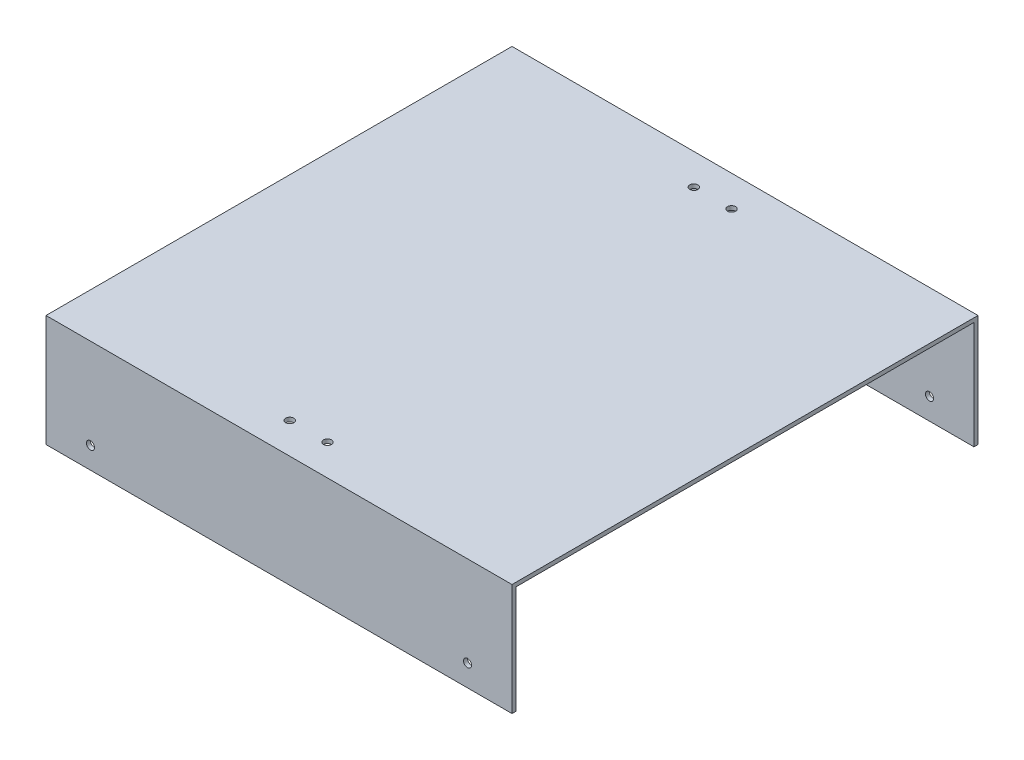
ISO-10303-21;
HEADER;
FILE_DESCRIPTION(('STEP AP214'),'2;1');
FILE_NAME('part.step','',(''),(''),'','','');
FILE_SCHEMA(('AUTOMOTIVE_DESIGN { 1 0 10303 214 1 1 1 1 }'));
ENDSEC;
DATA;
#1=APPLICATION_CONTEXT('core data for automotive mechanical design processes');
#2=APPLICATION_PROTOCOL_DEFINITION('international standard','automotive_design',2000,#1);
#3=PRODUCT_CONTEXT('',#1,'mechanical');
#4=PRODUCT('Part','Part','',(#3));
#5=PRODUCT_RELATED_PRODUCT_CATEGORY('part','',(#4));
#6=PRODUCT_DEFINITION_FORMATION('','',#4);
#7=PRODUCT_DEFINITION_CONTEXT('part definition',#1,'design');
#8=PRODUCT_DEFINITION('design','',#6,#7);
#9=PRODUCT_DEFINITION_SHAPE('','',#8);
#10=(LENGTH_UNIT() NAMED_UNIT(*) SI_UNIT(.MILLI.,.METRE.));
#11=(NAMED_UNIT(*) PLANE_ANGLE_UNIT() SI_UNIT($,.RADIAN.));
#12=(NAMED_UNIT(*) SI_UNIT($,.STERADIAN.) SOLID_ANGLE_UNIT());
#13=UNCERTAINTY_MEASURE_WITH_UNIT(LENGTH_MEASURE(1.E-05),#10,'distance_accuracy_value','');
#14=(GEOMETRIC_REPRESENTATION_CONTEXT(3) GLOBAL_UNCERTAINTY_ASSIGNED_CONTEXT((#13)) GLOBAL_UNIT_ASSIGNED_CONTEXT((#10,
#11,#12)) REPRESENTATION_CONTEXT('',''));
#15=CARTESIAN_POINT('',(0.,0.,0.));
#16=DIRECTION('',(0.,0.,1.));
#17=DIRECTION('',(1.,0.,0.));
#18=AXIS2_PLACEMENT_3D('',#15,#16,#17);
#19=CARTESIAN_POINT('',(0.,1.5,0.));
#20=DIRECTION('',(0.,-1.,0.));
#21=DIRECTION('',(0.,0.,-1.));
#22=AXIS2_PLACEMENT_3D('',#19,#20,#21);
#23=PLANE('',#22);
#24=CARTESIAN_POINT('',(93.,1.5,-10.));
#25=DIRECTION('',(0.,-1.,0.));
#26=DIRECTION('',(0.,0.,-1.));
#27=AXIS2_PLACEMENT_3D('',#24,#25,#26);
#28=CIRCLE('',#27,1.5);
#29=CARTESIAN_POINT('',(93.,1.5,-11.5));
#30=VERTEX_POINT('',#29);
#31=EDGE_CURVE('E249',#30,#30,#28,.F.);
#32=ORIENTED_EDGE('',*,*,#31,.F.);
#33=EDGE_LOOP('',(#32));
#34=FACE_BOUND('',#33,.T.);
#35=CARTESIAN_POINT('',(79.,1.5,-10.));
#36=DIRECTION('',(0.,-1.,0.));
#37=DIRECTION('',(0.,0.,-1.));
#38=AXIS2_PLACEMENT_3D('',#35,#36,#37);
#39=CIRCLE('',#38,1.5);
#40=CARTESIAN_POINT('',(79.,1.5,-11.5));
#41=VERTEX_POINT('',#40);
#42=EDGE_CURVE('E252',#41,#41,#39,.F.);
#43=ORIENTED_EDGE('',*,*,#42,.F.);
#44=EDGE_LOOP('',(#43));
#45=FACE_BOUND('',#44,.T.);
#46=DIRECTION('',(0.,0.,1.));
#47=VECTOR('',#46,1.);
#48=CARTESIAN_POINT('',(0.,1.5,0.));
#49=LINE('',#48,#47);
#50=CARTESIAN_POINT('',(0.,1.5,-171.5));
#51=VERTEX_POINT('',#50);
#52=CARTESIAN_POINT('',(0.,1.5,1.5));
#53=VERTEX_POINT('',#52);
#54=EDGE_CURVE('E41',#51,#53,#49,.T.);
#55=ORIENTED_EDGE('',*,*,#54,.T.);
#56=DIRECTION('',(-1.,0.,0.));
#57=VECTOR('',#56,1.);
#58=CARTESIAN_POINT('',(0.,1.5,1.5));
#59=LINE('',#58,#57);
#60=CARTESIAN_POINT('',(173.,1.5,1.5));
#61=VERTEX_POINT('',#60);
#62=EDGE_CURVE('E173',#61,#53,#59,.T.);
#63=ORIENTED_EDGE('',*,*,#62,.F.);
#64=DIRECTION('',(0.,0.,-1.));
#65=VECTOR('',#64,1.);
#66=CARTESIAN_POINT('',(173.,1.5,0.));
#67=LINE('',#66,#65);
#68=CARTESIAN_POINT('',(173.,1.5,-171.5));
#69=VERTEX_POINT('',#68);
#70=EDGE_CURVE('E11',#61,#69,#67,.T.);
#71=ORIENTED_EDGE('',*,*,#70,.T.);
#72=DIRECTION('',(1.,0.,0.));
#73=VECTOR('',#72,1.);
#74=CARTESIAN_POINT('',(173.,1.5,-171.5));
#75=LINE('',#74,#73);
#76=EDGE_CURVE('E116',#51,#69,#75,.T.);
#77=ORIENTED_EDGE('',*,*,#76,.F.);
#78=EDGE_LOOP('',(#55,#63,#71,#77));
#79=FACE_BOUND('',#78,.T.);
#80=CARTESIAN_POINT('',(79.,1.5,-160.));
#81=DIRECTION('',(0.,-1.,0.));
#82=DIRECTION('',(0.,0.,-1.));
#83=AXIS2_PLACEMENT_3D('',#80,#81,#82);
#84=CIRCLE('',#83,1.5);
#85=CARTESIAN_POINT('',(79.,1.5,-161.5));
#86=VERTEX_POINT('',#85);
#87=EDGE_CURVE('E259',#86,#86,#84,.F.);
#88=ORIENTED_EDGE('',*,*,#87,.F.);
#89=EDGE_LOOP('',(#88));
#90=FACE_BOUND('',#89,.T.);
#91=CARTESIAN_POINT('',(93.,1.5,-160.));
#92=DIRECTION('',(0.,-1.,0.));
#93=DIRECTION('',(0.,0.,-1.));
#94=AXIS2_PLACEMENT_3D('',#91,#92,#93);
#95=CIRCLE('',#94,1.5);
#96=CARTESIAN_POINT('',(93.,1.5,-161.5));
#97=VERTEX_POINT('',#96);
#98=EDGE_CURVE('E310',#97,#97,#95,.F.);
#99=ORIENTED_EDGE('',*,*,#98,.F.);
#100=EDGE_LOOP('',(#99));
#101=FACE_BOUND('',#100,.T.);
#102=ADVANCED_FACE('F32',(#34,#45,#79,#90,#101),#23,.F.);
#103=CARTESIAN_POINT('',(0.,0.,0.));
#104=DIRECTION('',(0.,-1.,0.));
#105=DIRECTION('',(0.,0.,-1.));
#106=AXIS2_PLACEMENT_3D('',#103,#104,#105);
#107=PLANE('',#106);
#108=CARTESIAN_POINT('',(93.,0.,-10.));
#109=DIRECTION('',(0.,-1.,0.));
#110=DIRECTION('',(0.,0.,-1.));
#111=AXIS2_PLACEMENT_3D('',#108,#109,#110);
#112=CIRCLE('',#111,1.5);
#113=CARTESIAN_POINT('',(93.,0.,-11.5));
#114=VERTEX_POINT('',#113);
#115=EDGE_CURVE('E312',#114,#114,#112,.F.);
#116=ORIENTED_EDGE('',*,*,#115,.T.);
#117=EDGE_LOOP('',(#116));
#118=FACE_BOUND('',#117,.T.);
#119=CARTESIAN_POINT('',(79.,0.,-10.));
#120=DIRECTION('',(0.,-1.,0.));
#121=DIRECTION('',(0.,0.,-1.));
#122=AXIS2_PLACEMENT_3D('',#119,#120,#121);
#123=CIRCLE('',#122,1.5);
#124=CARTESIAN_POINT('',(79.,0.,-11.5));
#125=VERTEX_POINT('',#124);
#126=EDGE_CURVE('E255',#125,#125,#123,.F.);
#127=ORIENTED_EDGE('',*,*,#126,.T.);
#128=EDGE_LOOP('',(#127));
#129=FACE_BOUND('',#128,.T.);
#130=DIRECTION('',(0.,0.,1.));
#131=VECTOR('',#130,1.);
#132=CARTESIAN_POINT('',(0.,0.,0.));
#133=LINE('',#132,#131);
#134=CARTESIAN_POINT('',(0.,0.,-170.));
#135=VERTEX_POINT('',#134);
#136=CARTESIAN_POINT('',(0.,0.,0.));
#137=VERTEX_POINT('',#136);
#138=EDGE_CURVE('E143',#135,#137,#133,.T.);
#139=ORIENTED_EDGE('',*,*,#138,.F.);
#140=DIRECTION('',(-1.,0.,0.));
#141=VECTOR('',#140,1.);
#142=CARTESIAN_POINT('',(0.,0.,-170.));
#143=LINE('',#142,#141);
#144=CARTESIAN_POINT('',(173.,0.,-170.));
#145=VERTEX_POINT('',#144);
#146=EDGE_CURVE('E149',#145,#135,#143,.T.);
#147=ORIENTED_EDGE('',*,*,#146,.F.);
#148=DIRECTION('',(0.,0.,-1.));
#149=VECTOR('',#148,1.);
#150=CARTESIAN_POINT('',(173.,0.,0.));
#151=LINE('',#150,#149);
#152=CARTESIAN_POINT('',(173.,0.,0.));
#153=VERTEX_POINT('',#152);
#154=EDGE_CURVE('E49',#153,#145,#151,.T.);
#155=ORIENTED_EDGE('',*,*,#154,.F.);
#156=DIRECTION('',(1.,0.,0.));
#157=VECTOR('',#156,1.);
#158=CARTESIAN_POINT('',(0.,0.,0.));
#159=LINE('',#158,#157);
#160=EDGE_CURVE('E56',#137,#153,#159,.T.);
#161=ORIENTED_EDGE('',*,*,#160,.F.);
#162=EDGE_LOOP('',(#139,#147,#155,#161));
#163=FACE_BOUND('',#162,.T.);
#164=CARTESIAN_POINT('',(79.,0.,-160.));
#165=DIRECTION('',(0.,-1.,0.));
#166=DIRECTION('',(0.,0.,-1.));
#167=AXIS2_PLACEMENT_3D('',#164,#165,#166);
#168=CIRCLE('',#167,1.5);
#169=CARTESIAN_POINT('',(79.,0.,-161.5));
#170=VERTEX_POINT('',#169);
#171=EDGE_CURVE('E315',#170,#170,#168,.F.);
#172=ORIENTED_EDGE('',*,*,#171,.T.);
#173=EDGE_LOOP('',(#172));
#174=FACE_BOUND('',#173,.T.);
#175=CARTESIAN_POINT('',(93.,0.,-160.));
#176=DIRECTION('',(0.,-1.,0.));
#177=DIRECTION('',(0.,0.,-1.));
#178=AXIS2_PLACEMENT_3D('',#175,#176,#177);
#179=CIRCLE('',#178,1.5);
#180=CARTESIAN_POINT('',(93.,0.,-161.5));
#181=VERTEX_POINT('',#180);
#182=EDGE_CURVE('E36',#181,#181,#179,.F.);
#183=ORIENTED_EDGE('',*,*,#182,.T.);
#184=EDGE_LOOP('',(#183));
#185=FACE_BOUND('',#184,.T.);
#186=ADVANCED_FACE('F205',(#118,#129,#163,#174,#185),#107,.T.);
#187=CARTESIAN_POINT('',(0.,0.,0.));
#188=DIRECTION('',(0.,0.,1.));
#189=DIRECTION('',(1.,0.,0.));
#190=AXIS2_PLACEMENT_3D('',#187,#188,#189);
#191=PLANE('',#190);
#192=CARTESIAN_POINT('',(156.5,-32.,0.));
#193=DIRECTION('',(0.,0.,1.));
#194=DIRECTION('',(1.,0.,0.));
#195=AXIS2_PLACEMENT_3D('',#192,#193,#194);
#196=CIRCLE('',#195,1.5);
#197=CARTESIAN_POINT('',(158.,-32.,0.));
#198=VERTEX_POINT('',#197);
#199=EDGE_CURVE('E133',#198,#198,#196,.F.);
#200=ORIENTED_EDGE('',*,*,#199,.F.);
#201=EDGE_LOOP('',(#200));
#202=FACE_BOUND('',#201,.T.);
#203=DIRECTION('',(0.,-1.,0.));
#204=VECTOR('',#203,1.);
#205=CARTESIAN_POINT('',(0.,1.5,0.));
#206=LINE('',#205,#204);
#207=CARTESIAN_POINT('',(0.,-40.,0.));
#208=VERTEX_POINT('',#207);
#209=EDGE_CURVE('E123',#137,#208,#206,.T.);
#210=ORIENTED_EDGE('',*,*,#209,.F.);
#211=ORIENTED_EDGE('',*,*,#160,.T.);
#212=DIRECTION('',(0.,1.,0.));
#213=VECTOR('',#212,1.);
#214=CARTESIAN_POINT('',(173.,1.5,0.));
#215=LINE('',#214,#213);
#216=CARTESIAN_POINT('',(173.,-40.,0.));
#217=VERTEX_POINT('',#216);
#218=EDGE_CURVE('E178',#217,#153,#215,.T.);
#219=ORIENTED_EDGE('',*,*,#218,.F.);
#220=DIRECTION('',(1.,0.,0.));
#221=VECTOR('',#220,1.);
#222=CARTESIAN_POINT('',(0.,-40.,0.));
#223=LINE('',#222,#221);
#224=EDGE_CURVE('E125',#208,#217,#223,.T.);
#225=ORIENTED_EDGE('',*,*,#224,.F.);
#226=EDGE_LOOP('',(#210,#211,#219,#225));
#227=FACE_BOUND('',#226,.T.);
#228=CARTESIAN_POINT('',(16.5,-32.,0.));
#229=DIRECTION('',(0.,0.,1.));
#230=DIRECTION('',(1.,0.,0.));
#231=AXIS2_PLACEMENT_3D('',#228,#229,#230);
#232=CIRCLE('',#231,1.5);
#233=CARTESIAN_POINT('',(18.,-32.,0.));
#234=VERTEX_POINT('',#233);
#235=EDGE_CURVE('E210',#234,#234,#232,.F.);
#236=ORIENTED_EDGE('',*,*,#235,.F.);
#237=EDGE_LOOP('',(#236));
#238=FACE_BOUND('',#237,.T.);
#239=ADVANCED_FACE('F202',(#202,#227,#238),#191,.F.);
#240=CARTESIAN_POINT('',(0.,0.,1.5));
#241=DIRECTION('',(0.,0.,1.));
#242=DIRECTION('',(1.,0.,0.));
#243=AXIS2_PLACEMENT_3D('',#240,#241,#242);
#244=PLANE('',#243);
#245=CARTESIAN_POINT('',(156.5,-32.,1.50000000000006));
#246=DIRECTION('',(0.,0.,1.));
#247=DIRECTION('',(1.,0.,0.));
#248=AXIS2_PLACEMENT_3D('',#245,#246,#247);
#249=CIRCLE('',#248,1.5);
#250=CARTESIAN_POINT('',(158.,-32.,1.50000000000006));
#251=VERTEX_POINT('',#250);
#252=EDGE_CURVE('E223',#251,#251,#249,.F.);
#253=ORIENTED_EDGE('',*,*,#252,.T.);
#254=EDGE_LOOP('',(#253));
#255=FACE_BOUND('',#254,.T.);
#256=DIRECTION('',(0.,-1.,0.));
#257=VECTOR('',#256,1.);
#258=CARTESIAN_POINT('',(0.,1.5,1.5));
#259=LINE('',#258,#257);
#260=CARTESIAN_POINT('',(0.,-40.,1.5));
#261=VERTEX_POINT('',#260);
#262=EDGE_CURVE('E186',#53,#261,#259,.T.);
#263=ORIENTED_EDGE('',*,*,#262,.T.);
#264=DIRECTION('',(1.,0.,0.));
#265=VECTOR('',#264,1.);
#266=CARTESIAN_POINT('',(0.,-40.,1.5));
#267=LINE('',#266,#265);
#268=CARTESIAN_POINT('',(173.,-40.,1.5));
#269=VERTEX_POINT('',#268);
#270=EDGE_CURVE('E189',#261,#269,#267,.T.);
#271=ORIENTED_EDGE('',*,*,#270,.T.);
#272=DIRECTION('',(0.,1.,0.));
#273=VECTOR('',#272,1.);
#274=CARTESIAN_POINT('',(173.,1.5,1.5));
#275=LINE('',#274,#273);
#276=EDGE_CURVE('E193',#269,#61,#275,.T.);
#277=ORIENTED_EDGE('',*,*,#276,.T.);
#278=ORIENTED_EDGE('',*,*,#62,.T.);
#279=EDGE_LOOP('',(#263,#271,#277,#278));
#280=FACE_BOUND('',#279,.T.);
#281=CARTESIAN_POINT('',(16.5,-32.,1.50000000000006));
#282=DIRECTION('',(0.,0.,1.));
#283=DIRECTION('',(1.,0.,0.));
#284=AXIS2_PLACEMENT_3D('',#281,#282,#283);
#285=CIRCLE('',#284,1.5);
#286=CARTESIAN_POINT('',(18.,-32.,1.50000000000006));
#287=VERTEX_POINT('',#286);
#288=EDGE_CURVE('E212',#287,#287,#285,.F.);
#289=ORIENTED_EDGE('',*,*,#288,.T.);
#290=EDGE_LOOP('',(#289));
#291=FACE_BOUND('',#290,.T.);
#292=ADVANCED_FACE('F198',(#255,#280,#291),#244,.T.);
#293=CARTESIAN_POINT('',(0.,0.,-170.));
#294=DIRECTION('',(0.,0.,-1.));
#295=DIRECTION('',(-1.,0.,0.));
#296=AXIS2_PLACEMENT_3D('',#293,#294,#295);
#297=PLANE('',#296);
#298=CARTESIAN_POINT('',(156.5,-32.,-170.));
#299=DIRECTION('',(0.,0.,-1.));
#300=DIRECTION('',(-1.,0.,0.));
#301=AXIS2_PLACEMENT_3D('',#298,#299,#300);
#302=CIRCLE('',#301,1.5);
#303=CARTESIAN_POINT('',(155.,-32.,-170.));
#304=VERTEX_POINT('',#303);
#305=EDGE_CURVE('E215',#304,#304,#302,.F.);
#306=ORIENTED_EDGE('',*,*,#305,.F.);
#307=EDGE_LOOP('',(#306));
#308=FACE_BOUND('',#307,.T.);
#309=DIRECTION('',(0.,-1.,0.));
#310=VECTOR('',#309,1.);
#311=CARTESIAN_POINT('',(173.,1.5,-170.));
#312=LINE('',#311,#310);
#313=CARTESIAN_POINT('',(173.,-40.,-170.));
#314=VERTEX_POINT('',#313);
#315=EDGE_CURVE('E121',#145,#314,#312,.T.);
#316=ORIENTED_EDGE('',*,*,#315,.F.);
#317=ORIENTED_EDGE('',*,*,#146,.T.);
#318=DIRECTION('',(0.,1.,0.));
#319=VECTOR('',#318,1.);
#320=CARTESIAN_POINT('',(0.,1.5,-170.));
#321=LINE('',#320,#319);
#322=CARTESIAN_POINT('',(0.,-40.,-170.));
#323=VERTEX_POINT('',#322);
#324=EDGE_CURVE('E117',#323,#135,#321,.T.);
#325=ORIENTED_EDGE('',*,*,#324,.F.);
#326=DIRECTION('',(-1.,0.,0.));
#327=VECTOR('',#326,1.);
#328=CARTESIAN_POINT('',(173.,-40.,-170.));
#329=LINE('',#328,#327);
#330=EDGE_CURVE('E132',#314,#323,#329,.T.);
#331=ORIENTED_EDGE('',*,*,#330,.F.);
#332=EDGE_LOOP('',(#316,#317,#325,#331));
#333=FACE_BOUND('',#332,.T.);
#334=CARTESIAN_POINT('',(16.5,-32.,-170.));
#335=DIRECTION('',(0.,0.,-1.));
#336=DIRECTION('',(-1.,0.,0.));
#337=AXIS2_PLACEMENT_3D('',#334,#335,#336);
#338=CIRCLE('',#337,1.5);
#339=CARTESIAN_POINT('',(15.,-32.,-170.));
#340=VERTEX_POINT('',#339);
#341=EDGE_CURVE('E217',#340,#340,#338,.F.);
#342=ORIENTED_EDGE('',*,*,#341,.F.);
#343=EDGE_LOOP('',(#342));
#344=FACE_BOUND('',#343,.T.);
#345=ADVANCED_FACE('F147',(#308,#333,#344),#297,.F.);
#346=CARTESIAN_POINT('',(0.,0.,-171.5));
#347=DIRECTION('',(0.,0.,-1.));
#348=DIRECTION('',(-1.,0.,0.));
#349=AXIS2_PLACEMENT_3D('',#346,#347,#348);
#350=PLANE('',#349);
#351=CARTESIAN_POINT('',(156.5,-32.,-171.5));
#352=DIRECTION('',(0.,0.,-1.));
#353=DIRECTION('',(-1.,0.,0.));
#354=AXIS2_PLACEMENT_3D('',#351,#352,#353);
#355=CIRCLE('',#354,1.5);
#356=CARTESIAN_POINT('',(155.,-32.,-171.5));
#357=VERTEX_POINT('',#356);
#358=EDGE_CURVE('E158',#357,#357,#355,.F.);
#359=ORIENTED_EDGE('',*,*,#358,.T.);
#360=EDGE_LOOP('',(#359));
#361=FACE_BOUND('',#360,.T.);
#362=DIRECTION('',(0.,-1.,0.));
#363=VECTOR('',#362,1.);
#364=CARTESIAN_POINT('',(173.,1.5,-171.5));
#365=LINE('',#364,#363);
#366=CARTESIAN_POINT('',(173.,-40.,-171.5));
#367=VERTEX_POINT('',#366);
#368=EDGE_CURVE('E109',#69,#367,#365,.T.);
#369=ORIENTED_EDGE('',*,*,#368,.T.);
#370=DIRECTION('',(-1.,0.,0.));
#371=VECTOR('',#370,1.);
#372=CARTESIAN_POINT('',(173.,-40.,-171.5));
#373=LINE('',#372,#371);
#374=CARTESIAN_POINT('',(0.,-40.,-171.5));
#375=VERTEX_POINT('',#374);
#376=EDGE_CURVE('E98',#367,#375,#373,.T.);
#377=ORIENTED_EDGE('',*,*,#376,.T.);
#378=DIRECTION('',(0.,1.,0.));
#379=VECTOR('',#378,1.);
#380=CARTESIAN_POINT('',(0.,1.5,-171.5));
#381=LINE('',#380,#379);
#382=EDGE_CURVE('E108',#375,#51,#381,.T.);
#383=ORIENTED_EDGE('',*,*,#382,.T.);
#384=ORIENTED_EDGE('',*,*,#76,.T.);
#385=EDGE_LOOP('',(#369,#377,#383,#384));
#386=FACE_BOUND('',#385,.T.);
#387=CARTESIAN_POINT('',(16.5,-32.,-171.5));
#388=DIRECTION('',(0.,0.,-1.));
#389=DIRECTION('',(-1.,0.,0.));
#390=AXIS2_PLACEMENT_3D('',#387,#388,#389);
#391=CIRCLE('',#390,1.5);
#392=CARTESIAN_POINT('',(15.,-32.,-171.5));
#393=VERTEX_POINT('',#392);
#394=EDGE_CURVE('E254',#393,#393,#391,.F.);
#395=ORIENTED_EDGE('',*,*,#394,.T.);
#396=EDGE_LOOP('',(#395));
#397=FACE_BOUND('',#396,.T.);
#398=ADVANCED_FACE('F113',(#361,#386,#397),#350,.T.);
#399=CARTESIAN_POINT('',(0.,1.5,0.));
#400=DIRECTION('',(1.,0.,0.));
#401=DIRECTION('',(0.,0.,-1.));
#402=AXIS2_PLACEMENT_3D('',#399,#400,#401);
#403=PLANE('',#402);
#404=ORIENTED_EDGE('',*,*,#138,.T.);
#405=ORIENTED_EDGE('',*,*,#209,.T.);
#406=DIRECTION('',(0.,0.,-1.));
#407=VECTOR('',#406,1.);
#408=CARTESIAN_POINT('',(0.,-40.,1.5));
#409=LINE('',#408,#407);
#410=EDGE_CURVE('E166',#261,#208,#409,.T.);
#411=ORIENTED_EDGE('',*,*,#410,.F.);
#412=ORIENTED_EDGE('',*,*,#262,.F.);
#413=ORIENTED_EDGE('',*,*,#54,.F.);
#414=ORIENTED_EDGE('',*,*,#382,.F.);
#415=DIRECTION('',(0.,0.,1.));
#416=VECTOR('',#415,1.);
#417=CARTESIAN_POINT('',(0.,-40.,-171.5));
#418=LINE('',#417,#416);
#419=EDGE_CURVE('E104',#375,#323,#418,.T.);
#420=ORIENTED_EDGE('',*,*,#419,.T.);
#421=ORIENTED_EDGE('',*,*,#324,.T.);
#422=EDGE_LOOP('',(#404,#405,#411,#412,#413,#414,#420,#421));
#423=FACE_BOUND('',#422,.T.);
#424=ADVANCED_FACE('F34',(#423),#403,.F.);
#425=CARTESIAN_POINT('',(173.,1.5,0.));
#426=DIRECTION('',(-1.,0.,0.));
#427=DIRECTION('',(0.,0.,1.));
#428=AXIS2_PLACEMENT_3D('',#425,#426,#427);
#429=PLANE('',#428);
#430=ORIENTED_EDGE('',*,*,#154,.T.);
#431=ORIENTED_EDGE('',*,*,#315,.T.);
#432=DIRECTION('',(0.,0.,1.));
#433=VECTOR('',#432,1.);
#434=CARTESIAN_POINT('',(173.,-40.,-171.5));
#435=LINE('',#434,#433);
#436=EDGE_CURVE('E102',#367,#314,#435,.T.);
#437=ORIENTED_EDGE('',*,*,#436,.F.);
#438=ORIENTED_EDGE('',*,*,#368,.F.);
#439=ORIENTED_EDGE('',*,*,#70,.F.);
#440=ORIENTED_EDGE('',*,*,#276,.F.);
#441=DIRECTION('',(0.,0.,-1.));
#442=VECTOR('',#441,1.);
#443=CARTESIAN_POINT('',(173.,-40.,1.5));
#444=LINE('',#443,#442);
#445=EDGE_CURVE('E168',#269,#217,#444,.T.);
#446=ORIENTED_EDGE('',*,*,#445,.T.);
#447=ORIENTED_EDGE('',*,*,#218,.T.);
#448=EDGE_LOOP('',(#430,#431,#437,#438,#439,#440,#446,#447));
#449=FACE_BOUND('',#448,.T.);
#450=ADVANCED_FACE('F119',(#449),#429,.F.);
#451=CARTESIAN_POINT('',(0.,-40.,1.5));
#452=DIRECTION('',(0.,1.,0.));
#453=DIRECTION('',(0.,0.,1.));
#454=AXIS2_PLACEMENT_3D('',#451,#452,#453);
#455=PLANE('',#454);
#456=ORIENTED_EDGE('',*,*,#224,.T.);
#457=ORIENTED_EDGE('',*,*,#445,.F.);
#458=ORIENTED_EDGE('',*,*,#270,.F.);
#459=ORIENTED_EDGE('',*,*,#410,.T.);
#460=EDGE_LOOP('',(#456,#457,#458,#459));
#461=FACE_BOUND('',#460,.T.);
#462=ADVANCED_FACE('F228',(#461),#455,.F.);
#463=CARTESIAN_POINT('',(173.,-40.,-171.5));
#464=DIRECTION('',(0.,1.,0.));
#465=DIRECTION('',(0.,0.,1.));
#466=AXIS2_PLACEMENT_3D('',#463,#464,#465);
#467=PLANE('',#466);
#468=ORIENTED_EDGE('',*,*,#330,.T.);
#469=ORIENTED_EDGE('',*,*,#419,.F.);
#470=ORIENTED_EDGE('',*,*,#376,.F.);
#471=ORIENTED_EDGE('',*,*,#436,.T.);
#472=EDGE_LOOP('',(#468,#469,#470,#471));
#473=FACE_BOUND('',#472,.T.);
#474=ADVANCED_FACE('F100',(#473),#467,.F.);
#475=CARTESIAN_POINT('',(156.5,-32.,-1171.5));
#476=DIRECTION('',(0.,0.,1.));
#477=DIRECTION('',(1.,0.,0.));
#478=AXIS2_PLACEMENT_3D('',#475,#476,#477);
#479=CYLINDRICAL_SURFACE('',#478,1.5);
#480=ORIENTED_EDGE('',*,*,#358,.F.);
#481=EDGE_LOOP('',(#480));
#482=FACE_BOUND('',#481,.T.);
#483=ORIENTED_EDGE('',*,*,#305,.T.);
#484=EDGE_LOOP('',(#483));
#485=FACE_BOUND('',#484,.T.);
#486=ADVANCED_FACE('F235',(#482,#485),#479,.F.);
#487=ORIENTED_EDGE('',*,*,#252,.F.);
#488=EDGE_LOOP('',(#487));
#489=FACE_BOUND('',#488,.T.);
#490=ORIENTED_EDGE('',*,*,#199,.T.);
#491=EDGE_LOOP('',(#490));
#492=FACE_BOUND('',#491,.T.);
#493=ADVANCED_FACE('F280',(#489,#492),#479,.F.);
#494=CARTESIAN_POINT('',(16.5,-32.,-1171.5));
#495=DIRECTION('',(0.,0.,1.));
#496=DIRECTION('',(1.,0.,0.));
#497=AXIS2_PLACEMENT_3D('',#494,#495,#496);
#498=CYLINDRICAL_SURFACE('',#497,1.5);
#499=ORIENTED_EDGE('',*,*,#394,.F.);
#500=EDGE_LOOP('',(#499));
#501=FACE_BOUND('',#500,.T.);
#502=ORIENTED_EDGE('',*,*,#341,.T.);
#503=EDGE_LOOP('',(#502));
#504=FACE_BOUND('',#503,.T.);
#505=ADVANCED_FACE('F266',(#501,#504),#498,.F.);
#506=ORIENTED_EDGE('',*,*,#288,.F.);
#507=EDGE_LOOP('',(#506));
#508=FACE_BOUND('',#507,.T.);
#509=ORIENTED_EDGE('',*,*,#235,.T.);
#510=EDGE_LOOP('',(#509));
#511=FACE_BOUND('',#510,.T.);
#512=ADVANCED_FACE('F284',(#508,#511),#498,.F.);
#513=CARTESIAN_POINT('',(79.,6.5,-10.));
#514=DIRECTION('',(0.,-1.,0.));
#515=DIRECTION('',(0.,0.,-1.));
#516=AXIS2_PLACEMENT_3D('',#513,#514,#515);
#517=CYLINDRICAL_SURFACE('',#516,1.5);
#518=ORIENTED_EDGE('',*,*,#126,.F.);
#519=EDGE_LOOP('',(#518));
#520=FACE_BOUND('',#519,.T.);
#521=ORIENTED_EDGE('',*,*,#42,.T.);
#522=EDGE_LOOP('',(#521));
#523=FACE_BOUND('',#522,.T.);
#524=ADVANCED_FACE('F287',(#520,#523),#517,.F.);
#525=CARTESIAN_POINT('',(79.,6.5,-160.));
#526=DIRECTION('',(0.,-1.,0.));
#527=DIRECTION('',(0.,0.,-1.));
#528=AXIS2_PLACEMENT_3D('',#525,#526,#527);
#529=CYLINDRICAL_SURFACE('',#528,1.5);
#530=ORIENTED_EDGE('',*,*,#171,.F.);
#531=EDGE_LOOP('',(#530));
#532=FACE_BOUND('',#531,.T.);
#533=ORIENTED_EDGE('',*,*,#87,.T.);
#534=EDGE_LOOP('',(#533));
#535=FACE_BOUND('',#534,.T.);
#536=ADVANCED_FACE('F291',(#532,#535),#529,.F.);
#537=CARTESIAN_POINT('',(93.,6.5,-10.));
#538=DIRECTION('',(0.,-1.,0.));
#539=DIRECTION('',(0.,0.,-1.));
#540=AXIS2_PLACEMENT_3D('',#537,#538,#539);
#541=CYLINDRICAL_SURFACE('',#540,1.5);
#542=ORIENTED_EDGE('',*,*,#115,.F.);
#543=EDGE_LOOP('',(#542));
#544=FACE_BOUND('',#543,.T.);
#545=ORIENTED_EDGE('',*,*,#31,.T.);
#546=EDGE_LOOP('',(#545));
#547=FACE_BOUND('',#546,.T.);
#548=ADVANCED_FACE('F295',(#544,#547),#541,.F.);
#549=CARTESIAN_POINT('',(93.,6.5,-160.));
#550=DIRECTION('',(0.,-1.,0.));
#551=DIRECTION('',(0.,0.,-1.));
#552=AXIS2_PLACEMENT_3D('',#549,#550,#551);
#553=CYLINDRICAL_SURFACE('',#552,1.5);
#554=ORIENTED_EDGE('',*,*,#182,.F.);
#555=EDGE_LOOP('',(#554));
#556=FACE_BOUND('',#555,.T.);
#557=ORIENTED_EDGE('',*,*,#98,.T.);
#558=EDGE_LOOP('',(#557));
#559=FACE_BOUND('',#558,.T.);
#560=ADVANCED_FACE('F299',(#556,#559),#553,.F.);
#561=CLOSED_SHELL('',(#102,#186,#239,#292,#345,#398,#424,#450,#462,#474,#486,#493,#505,#512,
#524,#536,#548,#560));
#562=MANIFOLD_SOLID_BREP('B2',#561);
#563=ADVANCED_BREP_SHAPE_REPRESENTATION('',(#18,#562),#14);
#564=SHAPE_DEFINITION_REPRESENTATION(#9,#563);
ENDSEC;
END-ISO-10303-21;
